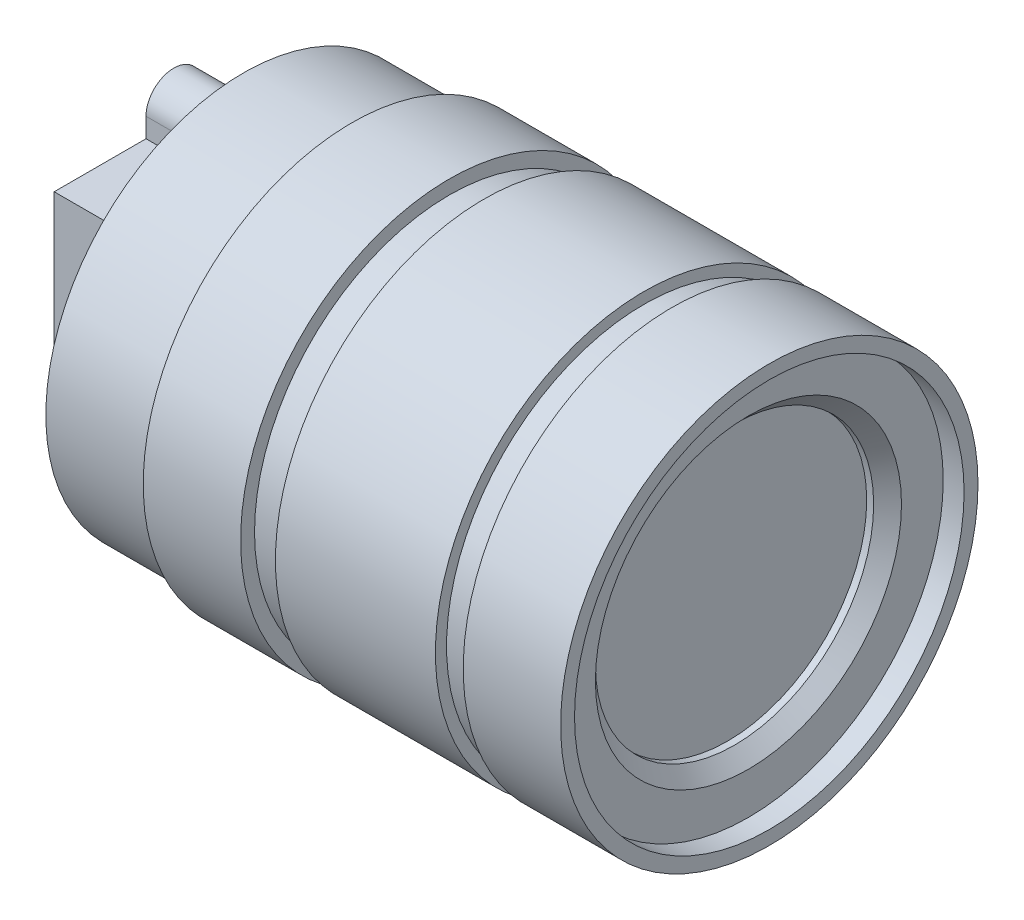
ISO-10303-21;
HEADER;
FILE_DESCRIPTION(('STEP AP214'),'2;1');
FILE_NAME('part.step','',(''),(''),'','','');
FILE_SCHEMA(('AUTOMOTIVE_DESIGN { 1 0 10303 214 1 1 1 1 }'));
ENDSEC;
DATA;
#1=APPLICATION_CONTEXT('core data for automotive mechanical design processes');
#2=APPLICATION_PROTOCOL_DEFINITION('international standard','automotive_design',2000,#1);
#3=PRODUCT_CONTEXT('',#1,'mechanical');
#4=PRODUCT('Part','Part','',(#3));
#5=PRODUCT_RELATED_PRODUCT_CATEGORY('part','',(#4));
#6=PRODUCT_DEFINITION_FORMATION('','',#4);
#7=PRODUCT_DEFINITION_CONTEXT('part definition',#1,'design');
#8=PRODUCT_DEFINITION('design','',#6,#7);
#9=PRODUCT_DEFINITION_SHAPE('','',#8);
#10=(LENGTH_UNIT() NAMED_UNIT(*) SI_UNIT(.MILLI.,.METRE.));
#11=(NAMED_UNIT(*) PLANE_ANGLE_UNIT() SI_UNIT($,.RADIAN.));
#12=(NAMED_UNIT(*) SI_UNIT($,.STERADIAN.) SOLID_ANGLE_UNIT());
#13=UNCERTAINTY_MEASURE_WITH_UNIT(LENGTH_MEASURE(1.E-05),#10,'distance_accuracy_value','');
#14=(GEOMETRIC_REPRESENTATION_CONTEXT(3) GLOBAL_UNCERTAINTY_ASSIGNED_CONTEXT((#13)) GLOBAL_UNIT_ASSIGNED_CONTEXT((#10,
#11,#12)) REPRESENTATION_CONTEXT('',''));
#15=CARTESIAN_POINT('',(0.,0.,0.));
#16=DIRECTION('',(0.,0.,1.));
#17=DIRECTION('',(1.,0.,0.));
#18=AXIS2_PLACEMENT_3D('',#15,#16,#17);
#19=CARTESIAN_POINT('',(5.,-8.6,-8.6));
#20=DIRECTION('',(0.,1.,0.));
#21=DIRECTION('',(0.,0.,1.));
#22=AXIS2_PLACEMENT_3D('',#19,#20,#21);
#23=PLANE('',#22);
#24=DIRECTION('',(-1.,0.,0.));
#25=VECTOR('',#24,1.);
#26=CARTESIAN_POINT('',(10.2497618993627,-8.6,2.));
#27=LINE('',#26,#25);
#28=CARTESIAN_POINT('',(5.,-8.6,2.));
#29=VERTEX_POINT('',#28);
#30=CARTESIAN_POINT('',(0.,-8.6,2.));
#31=VERTEX_POINT('',#30);
#32=EDGE_CURVE('E231',#29,#31,#27,.T.);
#33=ORIENTED_EDGE('',*,*,#32,.F.);
#34=DIRECTION('',(0.,0.,-1.));
#35=VECTOR('',#34,1.);
#36=CARTESIAN_POINT('',(5.,-8.6,-8.6));
#37=LINE('',#36,#35);
#38=CARTESIAN_POINT('',(5.,-8.6,8.6));
#39=VERTEX_POINT('',#38);
#40=EDGE_CURVE('E155',#39,#29,#37,.T.);
#41=ORIENTED_EDGE('',*,*,#40,.F.);
#42=DIRECTION('',(-1.,0.,0.));
#43=VECTOR('',#42,1.);
#44=CARTESIAN_POINT('',(5.,-8.6,8.6));
#45=LINE('',#44,#43);
#46=CARTESIAN_POINT('',(0.,-8.6,8.6));
#47=VERTEX_POINT('',#46);
#48=EDGE_CURVE('E134',#39,#47,#45,.T.);
#49=ORIENTED_EDGE('',*,*,#48,.T.);
#50=DIRECTION('',(0.,0.,-1.));
#51=VECTOR('',#50,1.);
#52=CARTESIAN_POINT('',(0.,-8.6,-8.6));
#53=LINE('',#52,#51);
#54=EDGE_CURVE('E163',#47,#31,#53,.T.);
#55=ORIENTED_EDGE('',*,*,#54,.T.);
#56=EDGE_LOOP('',(#33,#41,#49,#55));
#57=FACE_BOUND('',#56,.T.);
#58=ADVANCED_FACE('F37',(#57),#23,.F.);
#59=CARTESIAN_POINT('',(5.,8.6,-8.6));
#60=DIRECTION('',(0.,-1.,0.));
#61=DIRECTION('',(0.,0.,-1.));
#62=AXIS2_PLACEMENT_3D('',#59,#60,#61);
#63=PLANE('',#62);
#64=DIRECTION('',(-1.,0.,0.));
#65=VECTOR('',#64,1.);
#66=CARTESIAN_POINT('',(10.2497618993627,8.6,-2.));
#67=LINE('',#66,#65);
#68=CARTESIAN_POINT('',(5.,8.6,-2.));
#69=VERTEX_POINT('',#68);
#70=CARTESIAN_POINT('',(0.,8.6,-2.));
#71=VERTEX_POINT('',#70);
#72=EDGE_CURVE('E162',#69,#71,#67,.T.);
#73=ORIENTED_EDGE('',*,*,#72,.F.);
#74=DIRECTION('',(0.,0.,1.));
#75=VECTOR('',#74,1.);
#76=CARTESIAN_POINT('',(5.,8.6,-8.6));
#77=LINE('',#76,#75);
#78=CARTESIAN_POINT('',(5.,8.6,-8.6));
#79=VERTEX_POINT('',#78);
#80=EDGE_CURVE('E144',#79,#69,#77,.T.);
#81=ORIENTED_EDGE('',*,*,#80,.F.);
#82=DIRECTION('',(-1.,0.,0.));
#83=VECTOR('',#82,1.);
#84=CARTESIAN_POINT('',(5.,8.6,-8.6));
#85=LINE('',#84,#83);
#86=CARTESIAN_POINT('',(0.,8.6,-8.6));
#87=VERTEX_POINT('',#86);
#88=EDGE_CURVE('E143',#79,#87,#85,.T.);
#89=ORIENTED_EDGE('',*,*,#88,.T.);
#90=DIRECTION('',(0.,0.,1.));
#91=VECTOR('',#90,1.);
#92=CARTESIAN_POINT('',(0.,8.6,-8.6));
#93=LINE('',#92,#91);
#94=EDGE_CURVE('E138',#87,#71,#93,.T.);
#95=ORIENTED_EDGE('',*,*,#94,.T.);
#96=EDGE_LOOP('',(#73,#81,#89,#95));
#97=FACE_BOUND('',#96,.T.);
#98=ADVANCED_FACE('F282',(#97),#63,.F.);
#99=CARTESIAN_POINT('',(5.,-8.6,8.6));
#100=DIRECTION('',(0.,0.,-1.));
#101=DIRECTION('',(-1.,0.,0.));
#102=AXIS2_PLACEMENT_3D('',#99,#100,#101);
#103=PLANE('',#102);
#104=DIRECTION('',(0.,-1.,0.));
#105=VECTOR('',#104,1.);
#106=CARTESIAN_POINT('',(0.,-8.6,8.6));
#107=LINE('',#106,#105);
#108=CARTESIAN_POINT('',(0.,8.6,8.6));
#109=VERTEX_POINT('',#108);
#110=EDGE_CURVE('E159',#109,#47,#107,.T.);
#111=ORIENTED_EDGE('',*,*,#110,.T.);
#112=ORIENTED_EDGE('',*,*,#48,.F.);
#113=DIRECTION('',(0.,-1.,0.));
#114=VECTOR('',#113,1.);
#115=CARTESIAN_POINT('',(5.,-8.6,8.6));
#116=LINE('',#115,#114);
#117=CARTESIAN_POINT('',(5.,8.6,8.6));
#118=VERTEX_POINT('',#117);
#119=EDGE_CURVE('E128',#118,#39,#116,.T.);
#120=ORIENTED_EDGE('',*,*,#119,.F.);
#121=DIRECTION('',(-1.,0.,0.));
#122=VECTOR('',#121,1.);
#123=CARTESIAN_POINT('',(5.,8.6,8.6));
#124=LINE('',#123,#122);
#125=EDGE_CURVE('E131',#118,#109,#124,.T.);
#126=ORIENTED_EDGE('',*,*,#125,.T.);
#127=EDGE_LOOP('',(#111,#112,#120,#126));
#128=FACE_BOUND('',#127,.T.);
#129=ADVANCED_FACE('F130',(#128),#103,.F.);
#130=CARTESIAN_POINT('',(5.,-8.6,-2.));
#131=VERTEX_POINT('',#130);
#132=CARTESIAN_POINT('',(5.,-8.6,-8.6));
#133=VERTEX_POINT('',#132);
#134=EDGE_CURVE('E137',#131,#133,#37,.T.);
#135=ORIENTED_EDGE('',*,*,#134,.F.);
#136=DIRECTION('',(-1.,0.,0.));
#137=VECTOR('',#136,1.);
#138=CARTESIAN_POINT('',(10.2497618993627,-8.6,-2.));
#139=LINE('',#138,#137);
#140=CARTESIAN_POINT('',(0.,-8.6,-2.));
#141=VERTEX_POINT('',#140);
#142=EDGE_CURVE('E232',#131,#141,#139,.T.);
#143=ORIENTED_EDGE('',*,*,#142,.T.);
#144=CARTESIAN_POINT('',(0.,-8.6,-8.6));
#145=VERTEX_POINT('',#144);
#146=EDGE_CURVE('E161',#141,#145,#53,.T.);
#147=ORIENTED_EDGE('',*,*,#146,.T.);
#148=DIRECTION('',(-1.,0.,0.));
#149=VECTOR('',#148,1.);
#150=CARTESIAN_POINT('',(5.,-8.6,-8.6));
#151=LINE('',#150,#149);
#152=EDGE_CURVE('E171',#133,#145,#151,.T.);
#153=ORIENTED_EDGE('',*,*,#152,.F.);
#154=EDGE_LOOP('',(#135,#143,#147,#153));
#155=FACE_BOUND('',#154,.T.);
#156=ADVANCED_FACE('F274',(#155),#23,.F.);
#157=CARTESIAN_POINT('',(5.,-8.6,-8.6));
#158=DIRECTION('',(0.,0.,1.));
#159=DIRECTION('',(1.,0.,0.));
#160=AXIS2_PLACEMENT_3D('',#157,#158,#159);
#161=PLANE('',#160);
#162=DIRECTION('',(0.,1.,0.));
#163=VECTOR('',#162,1.);
#164=CARTESIAN_POINT('',(0.,-8.6,-8.6));
#165=LINE('',#164,#163);
#166=EDGE_CURVE('E166',#145,#87,#165,.T.);
#167=ORIENTED_EDGE('',*,*,#166,.T.);
#168=ORIENTED_EDGE('',*,*,#88,.F.);
#169=DIRECTION('',(0.,1.,0.));
#170=VECTOR('',#169,1.);
#171=CARTESIAN_POINT('',(5.,-8.6,-8.6));
#172=LINE('',#171,#170);
#173=EDGE_CURVE('E151',#133,#79,#172,.T.);
#174=ORIENTED_EDGE('',*,*,#173,.F.);
#175=ORIENTED_EDGE('',*,*,#152,.T.);
#176=EDGE_LOOP('',(#167,#168,#174,#175));
#177=FACE_BOUND('',#176,.T.);
#178=ADVANCED_FACE('F278',(#177),#161,.F.);
#179=CARTESIAN_POINT('',(5.,8.6,2.));
#180=VERTEX_POINT('',#179);
#181=EDGE_CURVE('E60',#180,#118,#77,.T.);
#182=ORIENTED_EDGE('',*,*,#181,.F.);
#183=DIRECTION('',(-1.,0.,0.));
#184=VECTOR('',#183,1.);
#185=CARTESIAN_POINT('',(10.2497618993627,8.6,2.));
#186=LINE('',#185,#184);
#187=CARTESIAN_POINT('',(0.,8.6,2.));
#188=VERTEX_POINT('',#187);
#189=EDGE_CURVE('E258',#180,#188,#186,.T.);
#190=ORIENTED_EDGE('',*,*,#189,.T.);
#191=EDGE_CURVE('E142',#188,#109,#93,.T.);
#192=ORIENTED_EDGE('',*,*,#191,.T.);
#193=ORIENTED_EDGE('',*,*,#125,.F.);
#194=EDGE_LOOP('',(#182,#190,#192,#193));
#195=FACE_BOUND('',#194,.T.);
#196=ADVANCED_FACE('F140',(#195),#63,.F.);
#197=CARTESIAN_POINT('',(0.,0.,0.));
#198=DIRECTION('',(1.,0.,0.));
#199=DIRECTION('',(0.,0.,-1.));
#200=AXIS2_PLACEMENT_3D('',#197,#198,#199);
#201=PLANE('',#200);
#202=ORIENTED_EDGE('',*,*,#110,.F.);
#203=ORIENTED_EDGE('',*,*,#191,.F.);
#204=DIRECTION('',(0.,-1.,0.));
#205=VECTOR('',#204,1.);
#206=CARTESIAN_POINT('',(0.,8.6,2.));
#207=LINE('',#206,#205);
#208=CARTESIAN_POINT('',(0.,10.,2.));
#209=VERTEX_POINT('',#208);
#210=EDGE_CURVE('E255',#209,#188,#207,.T.);
#211=ORIENTED_EDGE('',*,*,#210,.F.);
#212=CARTESIAN_POINT('',(0.,10.,0.));
#213=DIRECTION('',(1.,0.,0.));
#214=DIRECTION('',(0.,0.,1.));
#215=AXIS2_PLACEMENT_3D('',#212,#213,#214);
#216=CIRCLE('',#215,2.);
#217=CARTESIAN_POINT('',(0.,10.,-2.));
#218=VERTEX_POINT('',#217);
#219=EDGE_CURVE('E252',#218,#209,#216,.T.);
#220=ORIENTED_EDGE('',*,*,#219,.F.);
#221=DIRECTION('',(0.,1.,0.));
#222=VECTOR('',#221,1.);
#223=CARTESIAN_POINT('',(0.,8.6,-2.));
#224=LINE('',#223,#222);
#225=EDGE_CURVE('E249',#71,#218,#224,.T.);
#226=ORIENTED_EDGE('',*,*,#225,.F.);
#227=ORIENTED_EDGE('',*,*,#94,.F.);
#228=ORIENTED_EDGE('',*,*,#166,.F.);
#229=ORIENTED_EDGE('',*,*,#146,.F.);
#230=DIRECTION('',(0.,-1.,0.));
#231=VECTOR('',#230,1.);
#232=CARTESIAN_POINT('',(0.,-8.6,-2.));
#233=LINE('',#232,#231);
#234=CARTESIAN_POINT('',(0.,-10.,-2.));
#235=VERTEX_POINT('',#234);
#236=EDGE_CURVE('E52',#141,#235,#233,.T.);
#237=ORIENTED_EDGE('',*,*,#236,.T.);
#238=CARTESIAN_POINT('',(0.,-10.,0.));
#239=DIRECTION('',(-1.,0.,0.));
#240=DIRECTION('',(0.,0.,1.));
#241=AXIS2_PLACEMENT_3D('',#238,#239,#240);
#242=CIRCLE('',#241,2.);
#243=CARTESIAN_POINT('',(0.,-10.,2.));
#244=VERTEX_POINT('',#243);
#245=EDGE_CURVE('E212',#235,#244,#242,.T.);
#246=ORIENTED_EDGE('',*,*,#245,.T.);
#247=DIRECTION('',(0.,1.,0.));
#248=VECTOR('',#247,1.);
#249=CARTESIAN_POINT('',(0.,-8.6,2.));
#250=LINE('',#249,#248);
#251=EDGE_CURVE('E216',#244,#31,#250,.T.);
#252=ORIENTED_EDGE('',*,*,#251,.T.);
#253=ORIENTED_EDGE('',*,*,#54,.F.);
#254=EDGE_LOOP('',(#202,#203,#211,#220,#226,#227,#228,#229,#237,#246,#252,#253));
#255=FACE_BOUND('',#254,.T.);
#256=CARTESIAN_POINT('',(0.,10.,0.));
#257=DIRECTION('',(1.,0.,0.));
#258=DIRECTION('',(0.,0.,-1.));
#259=AXIS2_PLACEMENT_3D('',#256,#257,#258);
#260=CIRCLE('',#259,1.);
#261=CARTESIAN_POINT('',(0.,10.,-1.));
#262=VERTEX_POINT('',#261);
#263=EDGE_CURVE('E246',#262,#262,#260,.T.);
#264=ORIENTED_EDGE('',*,*,#263,.T.);
#265=EDGE_LOOP('',(#264));
#266=FACE_BOUND('',#265,.T.);
#267=CARTESIAN_POINT('',(0.,-10.,0.));
#268=DIRECTION('',(-1.,0.,0.));
#269=DIRECTION('',(0.,0.,-1.));
#270=AXIS2_PLACEMENT_3D('',#267,#268,#269);
#271=CIRCLE('',#270,1.);
#272=CARTESIAN_POINT('',(0.,-10.,-1.));
#273=VERTEX_POINT('',#272);
#274=EDGE_CURVE('E213',#273,#273,#271,.T.);
#275=ORIENTED_EDGE('',*,*,#274,.F.);
#276=EDGE_LOOP('',(#275));
#277=FACE_BOUND('',#276,.T.);
#278=ADVANCED_FACE('F295',(#255,#266,#277),#201,.F.);
#279=CARTESIAN_POINT('',(10.2497618993627,8.6,2.));
#280=DIRECTION('',(0.,0.,-1.));
#281=DIRECTION('',(-1.,0.,0.));
#282=AXIS2_PLACEMENT_3D('',#279,#280,#281);
#283=PLANE('',#282);
#284=DIRECTION('',(0.,-1.,0.));
#285=VECTOR('',#284,1.);
#286=CARTESIAN_POINT('',(5.,8.6,2.));
#287=LINE('',#286,#285);
#288=CARTESIAN_POINT('',(5.,10.,2.));
#289=VERTEX_POINT('',#288);
#290=EDGE_CURVE('E150',#289,#180,#287,.T.);
#291=ORIENTED_EDGE('',*,*,#290,.F.);
#292=DIRECTION('',(-1.,0.,0.));
#293=VECTOR('',#292,1.);
#294=CARTESIAN_POINT('',(10.2497618993627,10.,2.));
#295=LINE('',#294,#293);
#296=EDGE_CURVE('E260',#289,#209,#295,.T.);
#297=ORIENTED_EDGE('',*,*,#296,.T.);
#298=ORIENTED_EDGE('',*,*,#210,.T.);
#299=ORIENTED_EDGE('',*,*,#189,.F.);
#300=EDGE_LOOP('',(#291,#297,#298,#299));
#301=FACE_BOUND('',#300,.T.);
#302=ADVANCED_FACE('F293',(#301),#283,.F.);
#303=CARTESIAN_POINT('',(10.2497618993627,10.,0.));
#304=DIRECTION('',(-1.,0.,0.));
#305=DIRECTION('',(0.,0.,1.));
#306=AXIS2_PLACEMENT_3D('',#303,#304,#305);
#307=CYLINDRICAL_SURFACE('',#306,2.);
#308=CARTESIAN_POINT('',(5.,10.,0.));
#309=DIRECTION('',(1.,0.,0.));
#310=DIRECTION('',(0.,0.,-1.));
#311=AXIS2_PLACEMENT_3D('',#308,#309,#310);
#312=CIRCLE('',#311,2.);
#313=CARTESIAN_POINT('',(5.,10.,-2.));
#314=VERTEX_POINT('',#313);
#315=EDGE_CURVE('E241',#314,#289,#312,.T.);
#316=ORIENTED_EDGE('',*,*,#315,.F.);
#317=DIRECTION('',(-1.,0.,0.));
#318=VECTOR('',#317,1.);
#319=CARTESIAN_POINT('',(10.2497618993627,10.,-2.));
#320=LINE('',#319,#318);
#321=EDGE_CURVE('E262',#314,#218,#320,.T.);
#322=ORIENTED_EDGE('',*,*,#321,.T.);
#323=ORIENTED_EDGE('',*,*,#219,.T.);
#324=ORIENTED_EDGE('',*,*,#296,.F.);
#325=EDGE_LOOP('',(#316,#322,#323,#324));
#326=FACE_BOUND('',#325,.T.);
#327=ADVANCED_FACE('F290',(#326),#307,.T.);
#328=CARTESIAN_POINT('',(10.2497618993627,8.6,-2.));
#329=DIRECTION('',(0.,0.,1.));
#330=DIRECTION('',(1.,0.,0.));
#331=AXIS2_PLACEMENT_3D('',#328,#329,#330);
#332=PLANE('',#331);
#333=DIRECTION('',(0.,1.,0.));
#334=VECTOR('',#333,1.);
#335=CARTESIAN_POINT('',(5.,8.6,-2.));
#336=LINE('',#335,#334);
#337=EDGE_CURVE('E243',#69,#314,#336,.T.);
#338=ORIENTED_EDGE('',*,*,#337,.F.);
#339=ORIENTED_EDGE('',*,*,#72,.T.);
#340=ORIENTED_EDGE('',*,*,#225,.T.);
#341=ORIENTED_EDGE('',*,*,#321,.F.);
#342=EDGE_LOOP('',(#338,#339,#340,#341));
#343=FACE_BOUND('',#342,.T.);
#344=ADVANCED_FACE('F286',(#343),#332,.F.);
#345=CARTESIAN_POINT('',(10.2497618993627,10.,0.));
#346=DIRECTION('',(-1.,0.,0.));
#347=DIRECTION('',(0.,0.,1.));
#348=AXIS2_PLACEMENT_3D('',#345,#346,#347);
#349=CYLINDRICAL_SURFACE('',#348,1.);
#350=ORIENTED_EDGE('',*,*,#263,.F.);
#351=EDGE_LOOP('',(#350));
#352=FACE_BOUND('',#351,.T.);
#353=CARTESIAN_POINT('',(5.,10.,0.));
#354=DIRECTION('',(1.,0.,0.));
#355=DIRECTION('',(0.,0.,-1.));
#356=AXIS2_PLACEMENT_3D('',#353,#354,#355);
#357=CIRCLE('',#356,1.);
#358=CARTESIAN_POINT('',(5.,10.,-1.));
#359=VERTEX_POINT('',#358);
#360=EDGE_CURVE('E208',#359,#359,#357,.T.);
#361=ORIENTED_EDGE('',*,*,#360,.T.);
#362=EDGE_LOOP('',(#361));
#363=FACE_BOUND('',#362,.T.);
#364=ADVANCED_FACE('F368',(#352,#363),#349,.F.);
#365=CARTESIAN_POINT('',(10.2497618993627,-8.6,2.));
#366=DIRECTION('',(0.,0.,1.));
#367=DIRECTION('',(1.,0.,0.));
#368=AXIS2_PLACEMENT_3D('',#365,#366,#367);
#369=PLANE('',#368);
#370=DIRECTION('',(-1.,0.,0.));
#371=VECTOR('',#370,1.);
#372=CARTESIAN_POINT('',(10.2497618993627,-10.,2.));
#373=LINE('',#372,#371);
#374=CARTESIAN_POINT('',(5.,-10.,2.));
#375=VERTEX_POINT('',#374);
#376=EDGE_CURVE('E228',#375,#244,#373,.T.);
#377=ORIENTED_EDGE('',*,*,#376,.F.);
#378=DIRECTION('',(0.,1.,0.));
#379=VECTOR('',#378,1.);
#380=CARTESIAN_POINT('',(5.,-8.6,2.));
#381=LINE('',#380,#379);
#382=EDGE_CURVE('E229',#375,#29,#381,.T.);
#383=ORIENTED_EDGE('',*,*,#382,.T.);
#384=ORIENTED_EDGE('',*,*,#32,.T.);
#385=ORIENTED_EDGE('',*,*,#251,.F.);
#386=EDGE_LOOP('',(#377,#383,#384,#385));
#387=FACE_BOUND('',#386,.T.);
#388=ADVANCED_FACE('F301',(#387),#369,.T.);
#389=CARTESIAN_POINT('',(10.2497618993627,-10.,0.));
#390=DIRECTION('',(-1.,0.,0.));
#391=DIRECTION('',(0.,0.,1.));
#392=AXIS2_PLACEMENT_3D('',#389,#390,#391);
#393=CYLINDRICAL_SURFACE('',#392,2.);
#394=DIRECTION('',(-1.,0.,0.));
#395=VECTOR('',#394,1.);
#396=CARTESIAN_POINT('',(10.2497618993627,-10.,-2.));
#397=LINE('',#396,#395);
#398=CARTESIAN_POINT('',(5.,-10.,-2.));
#399=VERTEX_POINT('',#398);
#400=EDGE_CURVE('E222',#399,#235,#397,.T.);
#401=ORIENTED_EDGE('',*,*,#400,.F.);
#402=CARTESIAN_POINT('',(5.,-10.,0.));
#403=DIRECTION('',(1.,0.,0.));
#404=DIRECTION('',(0.,0.,-1.));
#405=AXIS2_PLACEMENT_3D('',#402,#403,#404);
#406=CIRCLE('',#405,2.);
#407=EDGE_CURVE('E233',#399,#375,#406,.F.);
#408=ORIENTED_EDGE('',*,*,#407,.T.);
#409=ORIENTED_EDGE('',*,*,#376,.T.);
#410=ORIENTED_EDGE('',*,*,#245,.F.);
#411=EDGE_LOOP('',(#401,#408,#409,#410));
#412=FACE_BOUND('',#411,.T.);
#413=ADVANCED_FACE('F303',(#412),#393,.T.);
#414=CARTESIAN_POINT('',(10.2497618993627,-8.6,-2.));
#415=DIRECTION('',(0.,0.,-1.));
#416=DIRECTION('',(-1.,0.,0.));
#417=AXIS2_PLACEMENT_3D('',#414,#415,#416);
#418=PLANE('',#417);
#419=ORIENTED_EDGE('',*,*,#142,.F.);
#420=DIRECTION('',(0.,-1.,0.));
#421=VECTOR('',#420,1.);
#422=CARTESIAN_POINT('',(5.,-8.6,-2.));
#423=LINE('',#422,#421);
#424=EDGE_CURVE('E225',#131,#399,#423,.T.);
#425=ORIENTED_EDGE('',*,*,#424,.T.);
#426=ORIENTED_EDGE('',*,*,#400,.T.);
#427=ORIENTED_EDGE('',*,*,#236,.F.);
#428=EDGE_LOOP('',(#419,#425,#426,#427));
#429=FACE_BOUND('',#428,.T.);
#430=ADVANCED_FACE('F305',(#429),#418,.T.);
#431=CARTESIAN_POINT('',(10.2497618993627,-10.,0.));
#432=DIRECTION('',(-1.,0.,0.));
#433=DIRECTION('',(0.,0.,1.));
#434=AXIS2_PLACEMENT_3D('',#431,#432,#433);
#435=CYLINDRICAL_SURFACE('',#434,1.);
#436=ORIENTED_EDGE('',*,*,#274,.T.);
#437=EDGE_LOOP('',(#436));
#438=FACE_BOUND('',#437,.T.);
#439=CARTESIAN_POINT('',(5.,-10.,0.));
#440=DIRECTION('',(1.,0.,0.));
#441=DIRECTION('',(0.,0.,-1.));
#442=AXIS2_PLACEMENT_3D('',#439,#440,#441);
#443=CIRCLE('',#442,1.);
#444=CARTESIAN_POINT('',(5.,-10.,-1.));
#445=VERTEX_POINT('',#444);
#446=EDGE_CURVE('E219',#445,#445,#443,.F.);
#447=ORIENTED_EDGE('',*,*,#446,.F.);
#448=EDGE_LOOP('',(#447));
#449=FACE_BOUND('',#448,.T.);
#450=ADVANCED_FACE('F307',(#438,#449),#435,.F.);
#451=CARTESIAN_POINT('',(5.,0.,0.));
#452=DIRECTION('',(1.,0.,0.));
#453=DIRECTION('',(0.,0.,-1.));
#454=AXIS2_PLACEMENT_3D('',#451,#452,#453);
#455=PLANE('',#454);
#456=ORIENTED_EDGE('',*,*,#446,.T.);
#457=EDGE_LOOP('',(#456));
#458=FACE_BOUND('',#457,.T.);
#459=ADVANCED_FACE('F313',(#458),#455,.F.);
#460=ORIENTED_EDGE('',*,*,#360,.F.);
#461=EDGE_LOOP('',(#460));
#462=FACE_BOUND('',#461,.T.);
#463=ADVANCED_FACE('F398',(#462),#455,.F.);
#464=CARTESIAN_POINT('',(5.,0.,0.));
#465=DIRECTION('',(1.,0.,0.));
#466=DIRECTION('',(0.,0.,-1.));
#467=AXIS2_PLACEMENT_3D('',#464,#465,#466);
#468=CIRCLE('',#467,14.2);
#469=CARTESIAN_POINT('',(5.,0.,-14.2));
#470=VERTEX_POINT('',#469);
#471=EDGE_CURVE('E202',#470,#470,#468,.T.);
#472=ORIENTED_EDGE('',*,*,#471,.F.);
#473=EDGE_LOOP('',(#472));
#474=FACE_BOUND('',#473,.T.);
#475=ORIENTED_EDGE('',*,*,#181,.T.);
#476=ORIENTED_EDGE('',*,*,#119,.T.);
#477=ORIENTED_EDGE('',*,*,#40,.T.);
#478=ORIENTED_EDGE('',*,*,#382,.F.);
#479=ORIENTED_EDGE('',*,*,#407,.F.);
#480=ORIENTED_EDGE('',*,*,#424,.F.);
#481=ORIENTED_EDGE('',*,*,#134,.T.);
#482=ORIENTED_EDGE('',*,*,#173,.T.);
#483=ORIENTED_EDGE('',*,*,#80,.T.);
#484=ORIENTED_EDGE('',*,*,#337,.T.);
#485=ORIENTED_EDGE('',*,*,#315,.T.);
#486=ORIENTED_EDGE('',*,*,#290,.T.);
#487=EDGE_LOOP('',(#475,#476,#477,#478,#479,#480,#481,#482,#483,#484,#485,#486));
#488=FACE_BOUND('',#487,.T.);
#489=ADVANCED_FACE('F147',(#474,#488),#455,.F.);
#490=CARTESIAN_POINT('',(12.8,0.,0.));
#491=DIRECTION('',(-1.,0.,0.));
#492=DIRECTION('',(0.,0.,1.));
#493=AXIS2_PLACEMENT_3D('',#490,#491,#492);
#494=CYLINDRICAL_SURFACE('',#493,14.2);
#495=CARTESIAN_POINT('',(12.8,0.,0.));
#496=DIRECTION('',(1.,0.,0.));
#497=DIRECTION('',(0.,0.,-1.));
#498=AXIS2_PLACEMENT_3D('',#495,#496,#497);
#499=CIRCLE('',#498,14.2);
#500=CARTESIAN_POINT('',(12.8,0.,-14.2));
#501=VERTEX_POINT('',#500);
#502=EDGE_CURVE('E205',#501,#501,#499,.T.);
#503=ORIENTED_EDGE('',*,*,#502,.F.);
#504=EDGE_LOOP('',(#503));
#505=FACE_BOUND('',#504,.T.);
#506=ORIENTED_EDGE('',*,*,#471,.T.);
#507=EDGE_LOOP('',(#506));
#508=FACE_BOUND('',#507,.T.);
#509=ADVANCED_FACE('F416',(#505,#508),#494,.T.);
#510=CARTESIAN_POINT('',(19.8,0.,0.));
#511=DIRECTION('',(-1.,0.,0.));
#512=DIRECTION('',(0.,0.,1.));
#513=AXIS2_PLACEMENT_3D('',#510,#511,#512);
#514=CYLINDRICAL_SURFACE('',#513,15.);
#515=CARTESIAN_POINT('',(19.8,0.,0.));
#516=DIRECTION('',(1.,0.,0.));
#517=DIRECTION('',(0.,0.,-1.));
#518=AXIS2_PLACEMENT_3D('',#515,#516,#517);
#519=CIRCLE('',#518,15.);
#520=CARTESIAN_POINT('',(19.8,0.,-15.));
#521=VERTEX_POINT('',#520);
#522=EDGE_CURVE('E199',#521,#521,#519,.T.);
#523=ORIENTED_EDGE('',*,*,#522,.F.);
#524=EDGE_LOOP('',(#523));
#525=FACE_BOUND('',#524,.T.);
#526=CARTESIAN_POINT('',(12.8,0.,0.));
#527=DIRECTION('',(1.,0.,0.));
#528=DIRECTION('',(0.,0.,-1.));
#529=AXIS2_PLACEMENT_3D('',#526,#527,#528);
#530=CIRCLE('',#529,15.);
#531=CARTESIAN_POINT('',(12.8,0.,-15.));
#532=VERTEX_POINT('',#531);
#533=EDGE_CURVE('E197',#532,#532,#530,.T.);
#534=ORIENTED_EDGE('',*,*,#533,.T.);
#535=EDGE_LOOP('',(#534));
#536=FACE_BOUND('',#535,.T.);
#537=ADVANCED_FACE('F425',(#525,#536),#514,.T.);
#538=CARTESIAN_POINT('',(19.8,0.,0.));
#539=DIRECTION('',(1.,0.,0.));
#540=DIRECTION('',(0.,0.,-1.));
#541=AXIS2_PLACEMENT_3D('',#538,#539,#540);
#542=PLANE('',#541);
#543=CARTESIAN_POINT('',(19.8,0.,0.));
#544=DIRECTION('',(1.,0.,0.));
#545=DIRECTION('',(0.,0.,-1.));
#546=AXIS2_PLACEMENT_3D('',#543,#544,#545);
#547=CIRCLE('',#546,14.);
#548=CARTESIAN_POINT('',(19.8,0.,-14.));
#549=VERTEX_POINT('',#548);
#550=EDGE_CURVE('E174',#549,#549,#547,.T.);
#551=ORIENTED_EDGE('',*,*,#550,.F.);
#552=EDGE_LOOP('',(#551));
#553=FACE_BOUND('',#552,.T.);
#554=ORIENTED_EDGE('',*,*,#522,.T.);
#555=EDGE_LOOP('',(#554));
#556=FACE_BOUND('',#555,.T.);
#557=ADVANCED_FACE('F434',(#553,#556),#542,.T.);
#558=CARTESIAN_POINT('',(12.8,0.,0.));
#559=DIRECTION('',(1.,0.,0.));
#560=DIRECTION('',(0.,0.,-1.));
#561=AXIS2_PLACEMENT_3D('',#558,#559,#560);
#562=PLANE('',#561);
#563=ORIENTED_EDGE('',*,*,#502,.T.);
#564=EDGE_LOOP('',(#563));
#565=FACE_BOUND('',#564,.T.);
#566=ORIENTED_EDGE('',*,*,#533,.F.);
#567=EDGE_LOOP('',(#566));
#568=FACE_BOUND('',#567,.T.);
#569=ADVANCED_FACE('F442',(#565,#568),#562,.F.);
#570=CARTESIAN_POINT('',(22.3,0.,0.));
#571=DIRECTION('',(-1.,0.,0.));
#572=DIRECTION('',(0.,0.,1.));
#573=AXIS2_PLACEMENT_3D('',#570,#571,#572);
#574=CYLINDRICAL_SURFACE('',#573,14.);
#575=CARTESIAN_POINT('',(22.3,0.,0.));
#576=DIRECTION('',(1.,0.,0.));
#577=DIRECTION('',(0.,0.,-1.));
#578=AXIS2_PLACEMENT_3D('',#575,#576,#577);
#579=CIRCLE('',#578,14.);
#580=CARTESIAN_POINT('',(22.3,0.,-14.));
#581=VERTEX_POINT('',#580);
#582=EDGE_CURVE('E192',#581,#581,#579,.T.);
#583=ORIENTED_EDGE('',*,*,#582,.F.);
#584=EDGE_LOOP('',(#583));
#585=FACE_BOUND('',#584,.T.);
#586=ORIENTED_EDGE('',*,*,#550,.T.);
#587=EDGE_LOOP('',(#586));
#588=FACE_BOUND('',#587,.T.);
#589=ADVANCED_FACE('F447',(#585,#588),#574,.T.);
#590=CARTESIAN_POINT('',(33.8,0.,0.));
#591=DIRECTION('',(-1.,0.,0.));
#592=DIRECTION('',(0.,0.,1.));
#593=AXIS2_PLACEMENT_3D('',#590,#591,#592);
#594=CYLINDRICAL_SURFACE('',#593,15.);
#595=CARTESIAN_POINT('',(33.8,0.,0.));
#596=DIRECTION('',(1.,0.,0.));
#597=DIRECTION('',(0.,0.,-1.));
#598=AXIS2_PLACEMENT_3D('',#595,#596,#597);
#599=CIRCLE('',#598,15.);
#600=CARTESIAN_POINT('',(33.8,0.,-15.));
#601=VERTEX_POINT('',#600);
#602=EDGE_CURVE('E189',#601,#601,#599,.T.);
#603=ORIENTED_EDGE('',*,*,#602,.F.);
#604=EDGE_LOOP('',(#603));
#605=FACE_BOUND('',#604,.T.);
#606=CARTESIAN_POINT('',(22.3,0.,0.));
#607=DIRECTION('',(1.,0.,0.));
#608=DIRECTION('',(0.,0.,-1.));
#609=AXIS2_PLACEMENT_3D('',#606,#607,#608);
#610=CIRCLE('',#609,15.);
#611=CARTESIAN_POINT('',(22.3,0.,-15.));
#612=VERTEX_POINT('',#611);
#613=EDGE_CURVE('E193',#612,#612,#610,.T.);
#614=ORIENTED_EDGE('',*,*,#613,.T.);
#615=EDGE_LOOP('',(#614));
#616=FACE_BOUND('',#615,.T.);
#617=ADVANCED_FACE('F464',(#605,#616),#594,.T.);
#618=CARTESIAN_POINT('',(33.8,0.,0.));
#619=DIRECTION('',(1.,0.,0.));
#620=DIRECTION('',(0.,0.,-1.));
#621=AXIS2_PLACEMENT_3D('',#618,#619,#620);
#622=PLANE('',#621);
#623=CARTESIAN_POINT('',(33.8,0.,0.));
#624=DIRECTION('',(1.,0.,0.));
#625=DIRECTION('',(0.,0.,-1.));
#626=AXIS2_PLACEMENT_3D('',#623,#624,#625);
#627=CIRCLE('',#626,14.2);
#628=CARTESIAN_POINT('',(33.8,0.,-14.2));
#629=VERTEX_POINT('',#628);
#630=EDGE_CURVE('E176',#629,#629,#627,.T.);
#631=ORIENTED_EDGE('',*,*,#630,.F.);
#632=EDGE_LOOP('',(#631));
#633=FACE_BOUND('',#632,.T.);
#634=ORIENTED_EDGE('',*,*,#602,.T.);
#635=EDGE_LOOP('',(#634));
#636=FACE_BOUND('',#635,.T.);
#637=ADVANCED_FACE('F474',(#633,#636),#622,.T.);
#638=CARTESIAN_POINT('',(22.3,0.,0.));
#639=DIRECTION('',(1.,0.,0.));
#640=DIRECTION('',(0.,0.,-1.));
#641=AXIS2_PLACEMENT_3D('',#638,#639,#640);
#642=PLANE('',#641);
#643=ORIENTED_EDGE('',*,*,#582,.T.);
#644=EDGE_LOOP('',(#643));
#645=FACE_BOUND('',#644,.T.);
#646=ORIENTED_EDGE('',*,*,#613,.F.);
#647=EDGE_LOOP('',(#646));
#648=FACE_BOUND('',#647,.T.);
#649=ADVANCED_FACE('F482',(#645,#648),#642,.F.);
#650=CARTESIAN_POINT('',(35.8,0.,0.));
#651=DIRECTION('',(-1.,0.,0.));
#652=DIRECTION('',(0.,0.,1.));
#653=AXIS2_PLACEMENT_3D('',#650,#651,#652);
#654=CYLINDRICAL_SURFACE('',#653,14.2);
#655=CARTESIAN_POINT('',(35.8,0.,0.));
#656=DIRECTION('',(1.,0.,0.));
#657=DIRECTION('',(0.,0.,-1.));
#658=AXIS2_PLACEMENT_3D('',#655,#656,#657);
#659=CIRCLE('',#658,14.2);
#660=CARTESIAN_POINT('',(35.8,0.,-14.2));
#661=VERTEX_POINT('',#660);
#662=EDGE_CURVE('E187',#661,#661,#659,.T.);
#663=ORIENTED_EDGE('',*,*,#662,.F.);
#664=EDGE_LOOP('',(#663));
#665=FACE_BOUND('',#664,.T.);
#666=ORIENTED_EDGE('',*,*,#630,.T.);
#667=EDGE_LOOP('',(#666));
#668=FACE_BOUND('',#667,.T.);
#669=ADVANCED_FACE('F487',(#665,#668),#654,.T.);
#670=CARTESIAN_POINT('',(42.8,0.,0.));
#671=DIRECTION('',(-1.,0.,0.));
#672=DIRECTION('',(0.,0.,1.));
#673=AXIS2_PLACEMENT_3D('',#670,#671,#672);
#674=CYLINDRICAL_SURFACE('',#673,15.);
#675=CARTESIAN_POINT('',(42.8,0.,0.));
#676=DIRECTION('',(1.,0.,0.));
#677=DIRECTION('',(0.,0.,-1.));
#678=AXIS2_PLACEMENT_3D('',#675,#676,#677);
#679=CIRCLE('',#678,15.);
#680=CARTESIAN_POINT('',(42.8,0.,-15.));
#681=VERTEX_POINT('',#680);
#682=EDGE_CURVE('E597',#681,#681,#679,.T.);
#683=ORIENTED_EDGE('',*,*,#682,.F.);
#684=EDGE_LOOP('',(#683));
#685=FACE_BOUND('',#684,.T.);
#686=CARTESIAN_POINT('',(35.8,0.,0.));
#687=DIRECTION('',(1.,0.,0.));
#688=DIRECTION('',(0.,0.,-1.));
#689=AXIS2_PLACEMENT_3D('',#686,#687,#688);
#690=CIRCLE('',#689,15.);
#691=CARTESIAN_POINT('',(35.8,0.,-15.));
#692=VERTEX_POINT('',#691);
#693=EDGE_CURVE('E593',#692,#692,#690,.T.);
#694=ORIENTED_EDGE('',*,*,#693,.T.);
#695=EDGE_LOOP('',(#694));
#696=FACE_BOUND('',#695,.T.);
#697=ADVANCED_FACE('F504',(#685,#696),#674,.T.);
#698=CARTESIAN_POINT('',(42.8,0.,0.));
#699=DIRECTION('',(1.,0.,0.));
#700=DIRECTION('',(0.,0.,-1.));
#701=AXIS2_PLACEMENT_3D('',#698,#699,#700);
#702=PLANE('',#701);
#703=CARTESIAN_POINT('',(42.8,0.,0.));
#704=DIRECTION('',(1.,0.,0.));
#705=DIRECTION('',(0.,0.,-1.));
#706=AXIS2_PLACEMENT_3D('',#703,#704,#705);
#707=CIRCLE('',#706,14.);
#708=CARTESIAN_POINT('',(42.8,0.,-14.));
#709=VERTEX_POINT('',#708);
#710=EDGE_CURVE('E594',#709,#709,#707,.T.);
#711=ORIENTED_EDGE('',*,*,#710,.F.);
#712=EDGE_LOOP('',(#711));
#713=FACE_BOUND('',#712,.T.);
#714=ORIENTED_EDGE('',*,*,#682,.T.);
#715=EDGE_LOOP('',(#714));
#716=FACE_BOUND('',#715,.T.);
#717=ADVANCED_FACE('F514',(#713,#716),#702,.T.);
#718=CARTESIAN_POINT('',(35.8,0.,0.));
#719=DIRECTION('',(1.,0.,0.));
#720=DIRECTION('',(0.,0.,-1.));
#721=AXIS2_PLACEMENT_3D('',#718,#719,#720);
#722=PLANE('',#721);
#723=ORIENTED_EDGE('',*,*,#662,.T.);
#724=EDGE_LOOP('',(#723));
#725=FACE_BOUND('',#724,.T.);
#726=ORIENTED_EDGE('',*,*,#693,.F.);
#727=EDGE_LOOP('',(#726));
#728=FACE_BOUND('',#727,.T.);
#729=ADVANCED_FACE('F522',(#725,#728),#722,.F.);
#730=CARTESIAN_POINT('',(41.3,0.,0.));
#731=DIRECTION('',(1.,0.,0.));
#732=DIRECTION('',(0.,0.,-1.));
#733=AXIS2_PLACEMENT_3D('',#730,#731,#732);
#734=CYLINDRICAL_SURFACE('',#733,14.);
#735=CARTESIAN_POINT('',(41.3,0.,0.));
#736=DIRECTION('',(1.,0.,0.));
#737=DIRECTION('',(0.,0.,-1.));
#738=AXIS2_PLACEMENT_3D('',#735,#736,#737);
#739=CIRCLE('',#738,14.);
#740=CARTESIAN_POINT('',(41.3,0.,-14.));
#741=VERTEX_POINT('',#740);
#742=EDGE_CURVE('E592',#741,#741,#739,.T.);
#743=ORIENTED_EDGE('',*,*,#742,.F.);
#744=EDGE_LOOP('',(#743));
#745=FACE_BOUND('',#744,.T.);
#746=ORIENTED_EDGE('',*,*,#710,.T.);
#747=EDGE_LOOP('',(#746));
#748=FACE_BOUND('',#747,.T.);
#749=ADVANCED_FACE('F527',(#745,#748),#734,.F.);
#750=CARTESIAN_POINT('',(41.3,0.,0.));
#751=DIRECTION('',(1.,0.,0.));
#752=DIRECTION('',(0.,0.,-1.));
#753=AXIS2_PLACEMENT_3D('',#750,#751,#752);
#754=PLANE('',#753);
#755=CARTESIAN_POINT('',(41.3,0.,0.));
#756=DIRECTION('',(1.,0.,0.));
#757=DIRECTION('',(0.,0.,-1.));
#758=AXIS2_PLACEMENT_3D('',#755,#756,#757);
#759=CIRCLE('',#758,11.);
#760=CARTESIAN_POINT('',(41.3,0.,-11.));
#761=VERTEX_POINT('',#760);
#762=EDGE_CURVE('E11',#761,#761,#759,.F.);
#763=ORIENTED_EDGE('',*,*,#762,.T.);
#764=EDGE_LOOP('',(#763));
#765=FACE_BOUND('',#764,.T.);
#766=ORIENTED_EDGE('',*,*,#742,.T.);
#767=EDGE_LOOP('',(#766));
#768=FACE_BOUND('',#767,.T.);
#769=ADVANCED_FACE('F544',(#765,#768),#754,.T.);
#770=CARTESIAN_POINT('',(39.8,0.,0.));
#771=DIRECTION('',(1.,0.,0.));
#772=DIRECTION('',(0.,0.,-1.));
#773=AXIS2_PLACEMENT_3D('',#770,#771,#772);
#774=CYLINDRICAL_SURFACE('',#773,10.);
#775=CARTESIAN_POINT('',(40.3,0.,0.));
#776=DIRECTION('',(1.,0.,0.));
#777=DIRECTION('',(0.,0.,-1.));
#778=AXIS2_PLACEMENT_3D('',#775,#776,#777);
#779=CIRCLE('',#778,10.);
#780=CARTESIAN_POINT('',(40.3,0.,-10.));
#781=VERTEX_POINT('',#780);
#782=EDGE_CURVE('E45',#781,#781,#779,.T.);
#783=ORIENTED_EDGE('',*,*,#782,.T.);
#784=EDGE_LOOP('',(#783));
#785=FACE_BOUND('',#784,.T.);
#786=CARTESIAN_POINT('',(39.8,0.,0.));
#787=DIRECTION('',(1.,0.,0.));
#788=DIRECTION('',(0.,0.,-1.));
#789=AXIS2_PLACEMENT_3D('',#786,#787,#788);
#790=CIRCLE('',#789,10.);
#791=CARTESIAN_POINT('',(39.8,0.,-10.));
#792=VERTEX_POINT('',#791);
#793=EDGE_CURVE('E599',#792,#792,#790,.T.);
#794=ORIENTED_EDGE('',*,*,#793,.F.);
#795=EDGE_LOOP('',(#794));
#796=FACE_BOUND('',#795,.T.);
#797=ADVANCED_FACE('F558',(#785,#796),#774,.F.);
#798=CARTESIAN_POINT('',(39.8,0.,0.));
#799=DIRECTION('',(1.,0.,0.));
#800=DIRECTION('',(0.,0.,-1.));
#801=AXIS2_PLACEMENT_3D('',#798,#799,#800);
#802=PLANE('',#801);
#803=ORIENTED_EDGE('',*,*,#793,.T.);
#804=EDGE_LOOP('',(#803));
#805=FACE_BOUND('',#804,.T.);
#806=ADVANCED_FACE('F552',(#805),#802,.T.);
#807=CARTESIAN_POINT('',(40.3,0.,0.));
#808=DIRECTION('',(1.,0.,0.));
#809=DIRECTION('',(0.,0.,-1.));
#810=AXIS2_PLACEMENT_3D('',#807,#808,#809);
#811=CONICAL_SURFACE('',#810,10.,0.785398163397453);
#812=ORIENTED_EDGE('',*,*,#762,.F.);
#813=EDGE_LOOP('',(#812));
#814=FACE_BOUND('',#813,.T.);
#815=ORIENTED_EDGE('',*,*,#782,.F.);
#816=EDGE_LOOP('',(#815));
#817=FACE_BOUND('',#816,.T.);
#818=ADVANCED_FACE('F39',(#814,#817),#811,.F.);
#819=CLOSED_SHELL('',(#58,#98,#129,#156,#178,#196,#278,#302,#327,#344,#364,#388,#413,#430,#450,
#459,#463,#489,#509,#537,#557,#569,#589,#617,#637,#649,#669,#697,#717,#729,#749,#769,#797,#806,#818));
#820=MANIFOLD_SOLID_BREP('B2',#819);
#821=ADVANCED_BREP_SHAPE_REPRESENTATION('',(#18,#820),#14);
#822=SHAPE_DEFINITION_REPRESENTATION(#9,#821);
ENDSEC;
END-ISO-10303-21;
